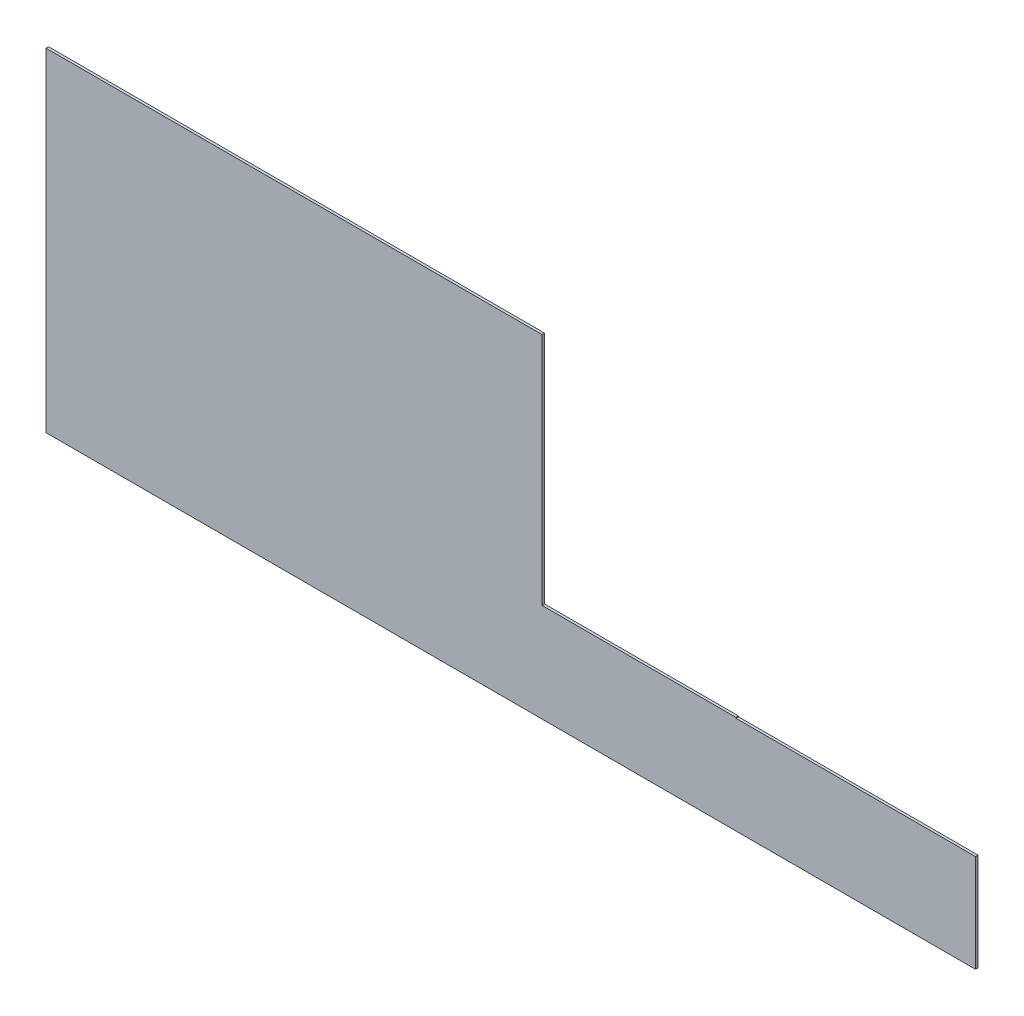
ISO-10303-21;
HEADER;
FILE_DESCRIPTION(('STEP AP214'),'2;1');
FILE_NAME('part.step','',(''),(''),'','','');
FILE_SCHEMA(('AUTOMOTIVE_DESIGN { 1 0 10303 214 1 1 1 1 }'));
ENDSEC;
DATA;
#1=APPLICATION_CONTEXT('core data for automotive mechanical design processes');
#2=APPLICATION_PROTOCOL_DEFINITION('international standard','automotive_design',2000,#1);
#3=PRODUCT_CONTEXT('',#1,'mechanical');
#4=PRODUCT('Part','Part','',(#3));
#5=PRODUCT_RELATED_PRODUCT_CATEGORY('part','',(#4));
#6=PRODUCT_DEFINITION_FORMATION('','',#4);
#7=PRODUCT_DEFINITION_CONTEXT('part definition',#1,'design');
#8=PRODUCT_DEFINITION('design','',#6,#7);
#9=PRODUCT_DEFINITION_SHAPE('','',#8);
#10=(LENGTH_UNIT() NAMED_UNIT(*) SI_UNIT(.MILLI.,.METRE.));
#11=(NAMED_UNIT(*) PLANE_ANGLE_UNIT() SI_UNIT($,.RADIAN.));
#12=(NAMED_UNIT(*) SI_UNIT($,.STERADIAN.) SOLID_ANGLE_UNIT());
#13=UNCERTAINTY_MEASURE_WITH_UNIT(LENGTH_MEASURE(1.E-05),#10,'distance_accuracy_value','');
#14=(GEOMETRIC_REPRESENTATION_CONTEXT(3) GLOBAL_UNCERTAINTY_ASSIGNED_CONTEXT((#13)) GLOBAL_UNIT_ASSIGNED_CONTEXT((#10,
#11,#12)) REPRESENTATION_CONTEXT('',''));
#15=CARTESIAN_POINT('',(0.,0.,0.));
#16=DIRECTION('',(0.,0.,1.));
#17=DIRECTION('',(1.,0.,0.));
#18=AXIS2_PLACEMENT_3D('',#15,#16,#17);
#19=CARTESIAN_POINT('',(-2685.,1755.,-10.));
#20=DIRECTION('',(1.,0.,0.));
#21=DIRECTION('',(0.,0.,-1.));
#22=AXIS2_PLACEMENT_3D('',#19,#20,#21);
#23=PLANE('',#22);
#24=DIRECTION('',(0.,1.,0.));
#25=VECTOR('',#24,1.);
#26=CARTESIAN_POINT('',(-2685.,1755.,-10.));
#27=LINE('',#26,#25);
#28=CARTESIAN_POINT('',(-2685.,385.,-10.));
#29=VERTEX_POINT('',#28);
#30=CARTESIAN_POINT('',(-2685.,388.,-10.));
#31=VERTEX_POINT('',#30);
#32=EDGE_CURVE('E154',#29,#31,#27,.T.);
#33=ORIENTED_EDGE('',*,*,#32,.T.);
#34=DIRECTION('',(0.,0.,1.));
#35=VECTOR('',#34,1.);
#36=CARTESIAN_POINT('',(-2685.,388.,-10.));
#37=LINE('',#36,#35);
#38=CARTESIAN_POINT('',(-2685.,388.,0.));
#39=VERTEX_POINT('',#38);
#40=EDGE_CURVE('E110',#31,#39,#37,.T.);
#41=ORIENTED_EDGE('',*,*,#40,.T.);
#42=DIRECTION('',(0.,1.,0.));
#43=VECTOR('',#42,1.);
#44=CARTESIAN_POINT('',(-2685.,1755.,0.));
#45=LINE('',#44,#43);
#46=CARTESIAN_POINT('',(-2685.,385.,0.));
#47=VERTEX_POINT('',#46);
#48=EDGE_CURVE('E155',#47,#39,#45,.T.);
#49=ORIENTED_EDGE('',*,*,#48,.F.);
#50=DIRECTION('',(0.,0.,1.));
#51=VECTOR('',#50,1.);
#52=CARTESIAN_POINT('',(-2685.,385.,-10.));
#53=LINE('',#52,#51);
#54=EDGE_CURVE('E143',#29,#47,#53,.T.);
#55=ORIENTED_EDGE('',*,*,#54,.F.);
#56=EDGE_LOOP('',(#33,#41,#49,#55));
#57=FACE_BOUND('',#56,.T.);
#58=ADVANCED_FACE('F38',(#57),#23,.T.);
#59=CARTESIAN_POINT('',(-6010.,0.,-10.));
#60=DIRECTION('',(0.,-1.,0.));
#61=DIRECTION('',(0.,0.,-1.));
#62=AXIS2_PLACEMENT_3D('',#59,#60,#61);
#63=PLANE('',#62);
#64=DIRECTION('',(0.,0.,1.));
#65=VECTOR('',#64,1.);
#66=CARTESIAN_POINT('',(-1740.,0.,-10.));
#67=LINE('',#66,#65);
#68=CARTESIAN_POINT('',(-1740.,0.,-10.));
#69=VERTEX_POINT('',#68);
#70=CARTESIAN_POINT('',(-1740.,0.,0.));
#71=VERTEX_POINT('',#70);
#72=EDGE_CURVE('E134',#69,#71,#67,.T.);
#73=ORIENTED_EDGE('',*,*,#72,.T.);
#74=DIRECTION('',(1.,0.,0.));
#75=VECTOR('',#74,1.);
#76=CARTESIAN_POINT('',(-6010.,0.,0.));
#77=LINE('',#76,#75);
#78=CARTESIAN_POINT('',(-5405.,0.,0.));
#79=VERTEX_POINT('',#78);
#80=EDGE_CURVE('E150',#79,#71,#77,.T.);
#81=ORIENTED_EDGE('',*,*,#80,.F.);
#82=DIRECTION('',(0.,0.,1.));
#83=VECTOR('',#82,1.);
#84=CARTESIAN_POINT('',(-5405.,0.,-10.));
#85=LINE('',#84,#83);
#86=CARTESIAN_POINT('',(-5405.,0.,-10.));
#87=VERTEX_POINT('',#86);
#88=EDGE_CURVE('E148',#87,#79,#85,.T.);
#89=ORIENTED_EDGE('',*,*,#88,.F.);
#90=DIRECTION('',(1.,0.,0.));
#91=VECTOR('',#90,1.);
#92=CARTESIAN_POINT('',(-6010.,0.,-10.));
#93=LINE('',#92,#91);
#94=EDGE_CURVE('E151',#87,#69,#93,.T.);
#95=ORIENTED_EDGE('',*,*,#94,.T.);
#96=EDGE_LOOP('',(#73,#81,#89,#95));
#97=FACE_BOUND('',#96,.T.);
#98=ADVANCED_FACE('F40',(#97),#63,.T.);
#99=CARTESIAN_POINT('',(0.,0.,-10.));
#100=DIRECTION('',(0.,0.,1.));
#101=DIRECTION('',(1.,0.,0.));
#102=AXIS2_PLACEMENT_3D('',#99,#100,#101);
#103=PLANE('',#102);
#104=DIRECTION('',(0.,1.,0.));
#105=VECTOR('',#104,1.);
#106=CARTESIAN_POINT('',(-5405.,2510.,-10.));
#107=LINE('',#106,#105);
#108=CARTESIAN_POINT('',(-5405.,1313.,-10.));
#109=VERTEX_POINT('',#108);
#110=EDGE_CURVE('E146',#87,#109,#107,.T.);
#111=ORIENTED_EDGE('',*,*,#110,.T.);
#112=DIRECTION('',(1.,0.,0.));
#113=VECTOR('',#112,1.);
#114=CARTESIAN_POINT('',(0.,1313.,-10.));
#115=LINE('',#114,#113);
#116=CARTESIAN_POINT('',(-3449.,1313.,-10.));
#117=VERTEX_POINT('',#116);
#118=EDGE_CURVE('E53',#109,#117,#115,.T.);
#119=ORIENTED_EDGE('',*,*,#118,.T.);
#120=DIRECTION('',(0.,1.,0.));
#121=VECTOR('',#120,1.);
#122=CARTESIAN_POINT('',(-3449.,0.,-10.));
#123=LINE('',#122,#121);
#124=CARTESIAN_POINT('',(-3449.,388.,-10.));
#125=VERTEX_POINT('',#124);
#126=EDGE_CURVE('E114',#125,#117,#123,.T.);
#127=ORIENTED_EDGE('',*,*,#126,.F.);
#128=DIRECTION('',(-1.,0.,0.));
#129=VECTOR('',#128,1.);
#130=CARTESIAN_POINT('',(0.,388.,-10.));
#131=LINE('',#130,#129);
#132=EDGE_CURVE('E104',#31,#125,#131,.T.);
#133=ORIENTED_EDGE('',*,*,#132,.F.);
#134=ORIENTED_EDGE('',*,*,#32,.F.);
#135=DIRECTION('',(1.,0.,0.));
#136=VECTOR('',#135,1.);
#137=CARTESIAN_POINT('',(0.,385.,-10.));
#138=LINE('',#137,#136);
#139=CARTESIAN_POINT('',(-1740.,385.,-10.));
#140=VERTEX_POINT('',#139);
#141=EDGE_CURVE('E140',#29,#140,#138,.T.);
#142=ORIENTED_EDGE('',*,*,#141,.T.);
#143=DIRECTION('',(0.,-1.,0.));
#144=VECTOR('',#143,1.);
#145=CARTESIAN_POINT('',(-1740.,385.,-10.));
#146=LINE('',#145,#144);
#147=EDGE_CURVE('E61',#140,#69,#146,.T.);
#148=ORIENTED_EDGE('',*,*,#147,.T.);
#149=ORIENTED_EDGE('',*,*,#94,.F.);
#150=EDGE_LOOP('',(#111,#119,#127,#133,#134,#142,#148,#149));
#151=FACE_BOUND('',#150,.T.);
#152=ADVANCED_FACE('F121',(#151),#103,.F.);
#153=CARTESIAN_POINT('',(0.,0.,0.));
#154=DIRECTION('',(0.,0.,1.));
#155=DIRECTION('',(1.,0.,0.));
#156=AXIS2_PLACEMENT_3D('',#153,#154,#155);
#157=PLANE('',#156);
#158=DIRECTION('',(1.,0.,0.));
#159=VECTOR('',#158,1.);
#160=CARTESIAN_POINT('',(0.,1313.,0.));
#161=LINE('',#160,#159);
#162=CARTESIAN_POINT('',(-5405.,1313.,0.));
#163=VERTEX_POINT('',#162);
#164=CARTESIAN_POINT('',(-3449.,1313.,0.));
#165=VERTEX_POINT('',#164);
#166=EDGE_CURVE('E127',#163,#165,#161,.T.);
#167=ORIENTED_EDGE('',*,*,#166,.F.);
#168=DIRECTION('',(0.,1.,0.));
#169=VECTOR('',#168,1.);
#170=CARTESIAN_POINT('',(-5405.,0.,0.));
#171=LINE('',#170,#169);
#172=EDGE_CURVE('E157',#79,#163,#171,.T.);
#173=ORIENTED_EDGE('',*,*,#172,.F.);
#174=ORIENTED_EDGE('',*,*,#80,.T.);
#175=DIRECTION('',(0.,-1.,0.));
#176=VECTOR('',#175,1.);
#177=CARTESIAN_POINT('',(-1740.,0.,0.));
#178=LINE('',#177,#176);
#179=CARTESIAN_POINT('',(-1740.,385.,0.));
#180=VERTEX_POINT('',#179);
#181=EDGE_CURVE('E137',#180,#71,#178,.T.);
#182=ORIENTED_EDGE('',*,*,#181,.F.);
#183=DIRECTION('',(1.,0.,0.));
#184=VECTOR('',#183,1.);
#185=CARTESIAN_POINT('',(0.,385.,0.));
#186=LINE('',#185,#184);
#187=EDGE_CURVE('E164',#47,#180,#186,.T.);
#188=ORIENTED_EDGE('',*,*,#187,.F.);
#189=ORIENTED_EDGE('',*,*,#48,.T.);
#190=DIRECTION('',(-1.,0.,0.));
#191=VECTOR('',#190,1.);
#192=CARTESIAN_POINT('',(0.,388.,0.));
#193=LINE('',#192,#191);
#194=CARTESIAN_POINT('',(-3449.,388.,0.));
#195=VERTEX_POINT('',#194);
#196=EDGE_CURVE('E46',#39,#195,#193,.T.);
#197=ORIENTED_EDGE('',*,*,#196,.T.);
#198=DIRECTION('',(0.,1.,0.));
#199=VECTOR('',#198,1.);
#200=CARTESIAN_POINT('',(-3449.,0.,0.));
#201=LINE('',#200,#199);
#202=EDGE_CURVE('E11',#195,#165,#201,.T.);
#203=ORIENTED_EDGE('',*,*,#202,.T.);
#204=EDGE_LOOP('',(#167,#173,#174,#182,#188,#189,#197,#203));
#205=FACE_BOUND('',#204,.T.);
#206=ADVANCED_FACE('F168',(#205),#157,.T.);
#207=CARTESIAN_POINT('',(-5405.,2510.,-10.));
#208=DIRECTION('',(1.,0.,0.));
#209=DIRECTION('',(0.,0.,-1.));
#210=AXIS2_PLACEMENT_3D('',#207,#208,#209);
#211=PLANE('',#210);
#212=ORIENTED_EDGE('',*,*,#172,.T.);
#213=DIRECTION('',(0.,0.,1.));
#214=VECTOR('',#213,1.);
#215=CARTESIAN_POINT('',(-5405.,1313.,-10.));
#216=LINE('',#215,#214);
#217=EDGE_CURVE('E128',#109,#163,#216,.T.);
#218=ORIENTED_EDGE('',*,*,#217,.F.);
#219=ORIENTED_EDGE('',*,*,#110,.F.);
#220=ORIENTED_EDGE('',*,*,#88,.T.);
#221=EDGE_LOOP('',(#212,#218,#219,#220));
#222=FACE_BOUND('',#221,.T.);
#223=ADVANCED_FACE('F183',(#222),#211,.F.);
#224=CARTESIAN_POINT('',(0.,385.,-10.));
#225=DIRECTION('',(0.,-1.,0.));
#226=DIRECTION('',(0.,0.,-1.));
#227=AXIS2_PLACEMENT_3D('',#224,#225,#226);
#228=PLANE('',#227);
#229=ORIENTED_EDGE('',*,*,#187,.T.);
#230=DIRECTION('',(0.,0.,1.));
#231=VECTOR('',#230,1.);
#232=CARTESIAN_POINT('',(-1740.,385.,-10.));
#233=LINE('',#232,#231);
#234=EDGE_CURVE('E133',#140,#180,#233,.T.);
#235=ORIENTED_EDGE('',*,*,#234,.F.);
#236=ORIENTED_EDGE('',*,*,#141,.F.);
#237=ORIENTED_EDGE('',*,*,#54,.T.);
#238=EDGE_LOOP('',(#229,#235,#236,#237));
#239=FACE_BOUND('',#238,.T.);
#240=ADVANCED_FACE('F175',(#239),#228,.F.);
#241=CARTESIAN_POINT('',(-1740.,385.,-10.));
#242=DIRECTION('',(-1.,0.,0.));
#243=DIRECTION('',(0.,0.,1.));
#244=AXIS2_PLACEMENT_3D('',#241,#242,#243);
#245=PLANE('',#244);
#246=ORIENTED_EDGE('',*,*,#181,.T.);
#247=ORIENTED_EDGE('',*,*,#72,.F.);
#248=ORIENTED_EDGE('',*,*,#147,.F.);
#249=ORIENTED_EDGE('',*,*,#234,.T.);
#250=EDGE_LOOP('',(#246,#247,#248,#249));
#251=FACE_BOUND('',#250,.T.);
#252=ADVANCED_FACE('F177',(#251),#245,.F.);
#253=CARTESIAN_POINT('',(-3449.,0.,-10.));
#254=DIRECTION('',(1.,0.,0.));
#255=DIRECTION('',(0.,0.,-1.));
#256=AXIS2_PLACEMENT_3D('',#253,#254,#255);
#257=PLANE('',#256);
#258=DIRECTION('',(0.,0.,1.));
#259=VECTOR('',#258,1.);
#260=CARTESIAN_POINT('',(-3449.,388.,-10.));
#261=LINE('',#260,#259);
#262=EDGE_CURVE('E107',#125,#195,#261,.T.);
#263=ORIENTED_EDGE('',*,*,#262,.F.);
#264=ORIENTED_EDGE('',*,*,#126,.T.);
#265=DIRECTION('',(0.,0.,1.));
#266=VECTOR('',#265,1.);
#267=CARTESIAN_POINT('',(-3449.,1313.,-10.));
#268=LINE('',#267,#266);
#269=EDGE_CURVE('E125',#117,#165,#268,.T.);
#270=ORIENTED_EDGE('',*,*,#269,.T.);
#271=ORIENTED_EDGE('',*,*,#202,.F.);
#272=EDGE_LOOP('',(#263,#264,#270,#271));
#273=FACE_BOUND('',#272,.T.);
#274=ADVANCED_FACE('F117',(#273),#257,.T.);
#275=CARTESIAN_POINT('',(0.,1313.,-10.));
#276=DIRECTION('',(0.,-1.,0.));
#277=DIRECTION('',(0.,0.,-1.));
#278=AXIS2_PLACEMENT_3D('',#275,#276,#277);
#279=PLANE('',#278);
#280=ORIENTED_EDGE('',*,*,#166,.T.);
#281=ORIENTED_EDGE('',*,*,#269,.F.);
#282=ORIENTED_EDGE('',*,*,#118,.F.);
#283=ORIENTED_EDGE('',*,*,#217,.T.);
#284=EDGE_LOOP('',(#280,#281,#282,#283));
#285=FACE_BOUND('',#284,.T.);
#286=ADVANCED_FACE('F184',(#285),#279,.F.);
#287=CARTESIAN_POINT('',(0.,388.,-10.));
#288=DIRECTION('',(0.,1.,0.));
#289=DIRECTION('',(-1.,0.,0.));
#290=AXIS2_PLACEMENT_3D('',#287,#288,#289);
#291=PLANE('',#290);
#292=ORIENTED_EDGE('',*,*,#40,.F.);
#293=ORIENTED_EDGE('',*,*,#132,.T.);
#294=ORIENTED_EDGE('',*,*,#262,.T.);
#295=ORIENTED_EDGE('',*,*,#196,.F.);
#296=EDGE_LOOP('',(#292,#293,#294,#295));
#297=FACE_BOUND('',#296,.T.);
#298=ADVANCED_FACE('F106',(#297),#291,.T.);
#299=CLOSED_SHELL('',(#58,#98,#152,#206,#223,#240,#252,#274,#286,#298));
#300=MANIFOLD_SOLID_BREP('B2',#299);
#301=ADVANCED_BREP_SHAPE_REPRESENTATION('',(#18,#300),#14);
#302=SHAPE_DEFINITION_REPRESENTATION(#9,#301);
ENDSEC;
END-ISO-10303-21;
